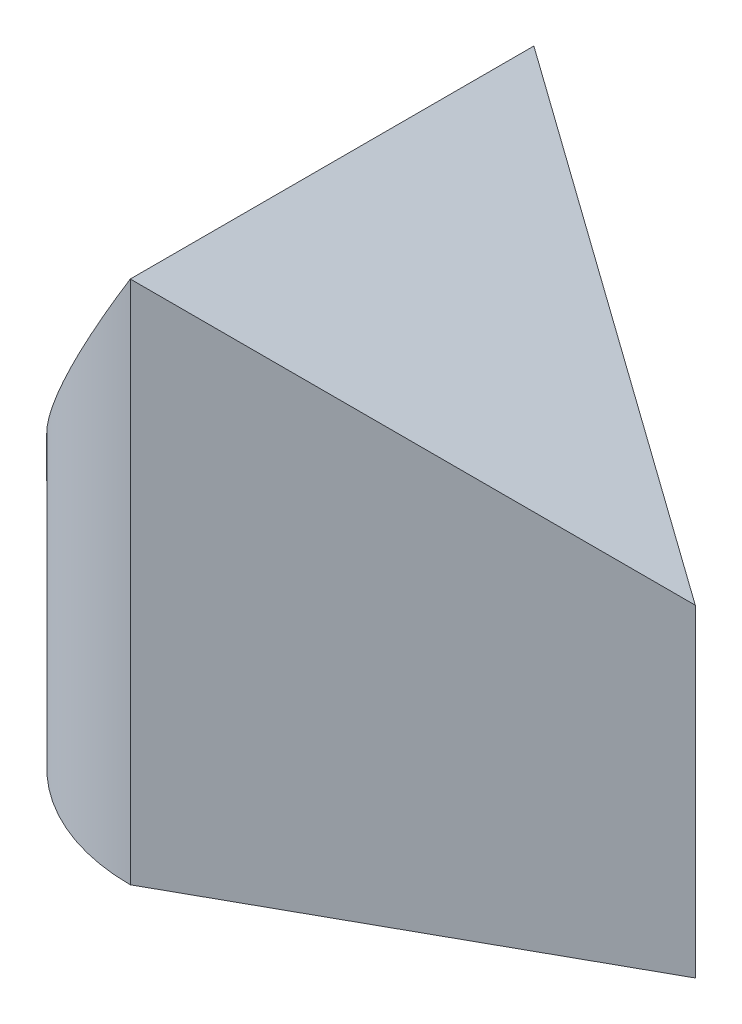
ISO-10303-21;
HEADER;
FILE_DESCRIPTION(('STEP AP214'),'2;1');
FILE_NAME('part.step','',(''),(''),'','','');
FILE_SCHEMA(('AUTOMOTIVE_DESIGN { 1 0 10303 214 1 1 1 1 }'));
ENDSEC;
DATA;
#1=APPLICATION_CONTEXT('core data for automotive mechanical design processes');
#2=APPLICATION_PROTOCOL_DEFINITION('international standard','automotive_design',2000,#1);
#3=PRODUCT_CONTEXT('',#1,'mechanical');
#4=PRODUCT('Part','Part','',(#3));
#5=PRODUCT_RELATED_PRODUCT_CATEGORY('part','',(#4));
#6=PRODUCT_DEFINITION_FORMATION('','',#4);
#7=PRODUCT_DEFINITION_CONTEXT('part definition',#1,'design');
#8=PRODUCT_DEFINITION('design','',#6,#7);
#9=PRODUCT_DEFINITION_SHAPE('','',#8);
#10=(LENGTH_UNIT() NAMED_UNIT(*) SI_UNIT(.MILLI.,.METRE.));
#11=(NAMED_UNIT(*) PLANE_ANGLE_UNIT() SI_UNIT($,.RADIAN.));
#12=(NAMED_UNIT(*) SI_UNIT($,.STERADIAN.) SOLID_ANGLE_UNIT());
#13=UNCERTAINTY_MEASURE_WITH_UNIT(LENGTH_MEASURE(1.E-05),#10,'distance_accuracy_value','');
#14=(GEOMETRIC_REPRESENTATION_CONTEXT(3) GLOBAL_UNCERTAINTY_ASSIGNED_CONTEXT((#13)) GLOBAL_UNIT_ASSIGNED_CONTEXT((#10,
#11,#12)) REPRESENTATION_CONTEXT('',''));
#15=CARTESIAN_POINT('',(0.,0.,0.));
#16=DIRECTION('',(0.,0.,1.));
#17=DIRECTION('',(1.,0.,0.));
#18=AXIS2_PLACEMENT_3D('',#15,#16,#17);
#19=CARTESIAN_POINT('',(45.,65.,0.));
#20=DIRECTION('',(-0.485642931178632,0.,-0.874157276121538));
#21=DIRECTION('',(-0.874157276121538,0.,0.485642931178632));
#22=AXIS2_PLACEMENT_3D('',#19,#20,#21);
#23=PLANE('',#22);
#24=DIRECTION('',(0.786333650994934,-0.436852028330519,-0.436852028330519));
#25=VECTOR('',#24,1.);
#26=CARTESIAN_POINT('',(36.412213740458,44.7709923664122,4.77099236641221));
#27=LINE('',#26,#25);
#28=CARTESIAN_POINT('',(0.,65.,25.));
#29=VERTEX_POINT('',#28);
#30=CARTESIAN_POINT('',(45.,40.,0.));
#31=VERTEX_POINT('',#30);
#32=EDGE_CURVE('E85',#29,#31,#27,.T.);
#33=ORIENTED_EDGE('',*,*,#32,.F.);
#34=DIRECTION('',(0.,-1.,0.));
#35=VECTOR('',#34,1.);
#36=CARTESIAN_POINT('',(0.,65.,25.));
#37=LINE('',#36,#35);
#38=CARTESIAN_POINT('',(0.,0.,25.));
#39=VERTEX_POINT('',#38);
#40=EDGE_CURVE('E12',#29,#39,#37,.T.);
#41=ORIENTED_EDGE('',*,*,#40,.T.);
#42=DIRECTION('',(0.874157276121538,0.,-0.485642931178632));
#43=VECTOR('',#42,1.);
#44=CARTESIAN_POINT('',(45.,0.,0.));
#45=LINE('',#44,#43);
#46=CARTESIAN_POINT('',(45.,0.,0.));
#47=VERTEX_POINT('',#46);
#48=EDGE_CURVE('E103',#39,#47,#45,.T.);
#49=ORIENTED_EDGE('',*,*,#48,.T.);
#50=DIRECTION('',(0.,-1.,0.));
#51=VECTOR('',#50,1.);
#52=CARTESIAN_POINT('',(45.,65.,0.));
#53=LINE('',#52,#51);
#54=EDGE_CURVE('E56',#31,#47,#53,.T.);
#55=ORIENTED_EDGE('',*,*,#54,.F.);
#56=EDGE_LOOP('',(#33,#41,#49,#55));
#57=FACE_BOUND('',#56,.T.);
#58=ADVANCED_FACE('F48',(#57),#23,.F.);
#59=CARTESIAN_POINT('',(0.,65.,-25.));
#60=DIRECTION('',(-0.485642931178632,0.,0.874157276121538));
#61=DIRECTION('',(0.874157276121538,0.,0.485642931178632));
#62=AXIS2_PLACEMENT_3D('',#59,#60,#61);
#63=PLANE('',#62);
#64=DIRECTION('',(-0.786333650994934,0.436852028330519,-0.436852028330519));
#65=VECTOR('',#64,1.);
#66=CARTESIAN_POINT('',(0.,65.,-25.));
#67=LINE('',#66,#65);
#68=CARTESIAN_POINT('',(0.,65.,-25.));
#69=VERTEX_POINT('',#68);
#70=EDGE_CURVE('E86',#31,#69,#67,.T.);
#71=ORIENTED_EDGE('',*,*,#70,.F.);
#72=ORIENTED_EDGE('',*,*,#54,.T.);
#73=DIRECTION('',(-0.874157276121538,0.,-0.485642931178632));
#74=VECTOR('',#73,1.);
#75=CARTESIAN_POINT('',(0.,0.,-25.));
#76=LINE('',#75,#74);
#77=CARTESIAN_POINT('',(0.,0.,-25.));
#78=VERTEX_POINT('',#77);
#79=EDGE_CURVE('E63',#47,#78,#76,.T.);
#80=ORIENTED_EDGE('',*,*,#79,.T.);
#81=DIRECTION('',(0.,-1.,0.));
#82=VECTOR('',#81,1.);
#83=CARTESIAN_POINT('',(0.,65.,-25.));
#84=LINE('',#83,#82);
#85=EDGE_CURVE('E101',#69,#78,#84,.T.);
#86=ORIENTED_EDGE('',*,*,#85,.F.);
#87=EDGE_LOOP('',(#71,#72,#80,#86));
#88=FACE_BOUND('',#87,.T.);
#89=ADVANCED_FACE('F117',(#88),#63,.F.);
#90=CARTESIAN_POINT('',(0.,65.,0.));
#91=DIRECTION('',(0.,-1.,0.));
#92=DIRECTION('',(0.,0.,-1.));
#93=AXIS2_PLACEMENT_3D('',#90,#91,#92);
#94=CYLINDRICAL_SURFACE('',#93,25.);
#95=CARTESIAN_POINT('',(0.,65.,0.));
#96=DIRECTION('',(0.853796175794036,-0.520607424264656,0.));
#97=DIRECTION('',(-0.520607424264656,-0.853796175794036,0.));
#98=AXIS2_PLACEMENT_3D('',#95,#96,#97);
#99=ELLIPSE('',#98,48.0208288141719,25.);
#100=EDGE_CURVE('E90',#29,#69,#99,.T.);
#101=ORIENTED_EDGE('',*,*,#100,.T.);
#102=ORIENTED_EDGE('',*,*,#85,.T.);
#103=CARTESIAN_POINT('',(0.,0.,0.));
#104=DIRECTION('',(0.,1.,0.));
#105=DIRECTION('',(0.,0.,1.));
#106=AXIS2_PLACEMENT_3D('',#103,#104,#105);
#107=CIRCLE('',#106,25.);
#108=EDGE_CURVE('E98',#78,#39,#107,.T.);
#109=ORIENTED_EDGE('',*,*,#108,.T.);
#110=ORIENTED_EDGE('',*,*,#40,.F.);
#111=EDGE_LOOP('',(#101,#102,#109,#110));
#112=FACE_BOUND('',#111,.T.);
#113=ADVANCED_FACE('F50',(#112),#94,.T.);
#114=CARTESIAN_POINT('',(0.,0.,0.));
#115=DIRECTION('',(0.,1.,0.));
#116=DIRECTION('',(0.,0.,1.));
#117=AXIS2_PLACEMENT_3D('',#114,#115,#116);
#118=PLANE('',#117);
#119=ORIENTED_EDGE('',*,*,#108,.F.);
#120=ORIENTED_EDGE('',*,*,#79,.F.);
#121=ORIENTED_EDGE('',*,*,#48,.F.);
#122=EDGE_LOOP('',(#119,#120,#121));
#123=FACE_BOUND('',#122,.T.);
#124=ADVANCED_FACE('F109',(#123),#118,.F.);
#125=CARTESIAN_POINT('',(-25.,24.,-25.));
#126=DIRECTION('',(0.853796175794036,-0.520607424264656,0.));
#127=DIRECTION('',(0.520607424264656,0.853796175794036,0.));
#128=AXIS2_PLACEMENT_3D('',#125,#126,#127);
#129=PLANE('',#128);
#130=ORIENTED_EDGE('',*,*,#100,.F.);
#131=DIRECTION('',(0.,0.,1.));
#132=VECTOR('',#131,1.);
#133=CARTESIAN_POINT('',(0.,65.,-25.));
#134=LINE('',#133,#132);
#135=EDGE_CURVE('E82',#69,#29,#134,.T.);
#136=ORIENTED_EDGE('',*,*,#135,.F.);
#137=EDGE_LOOP('',(#130,#136));
#138=FACE_BOUND('',#137,.T.);
#139=ADVANCED_FACE('F96',(#138),#129,.F.);
#140=CARTESIAN_POINT('',(45.,40.,-25.));
#141=DIRECTION('',(0.485642931178632,0.874157276121538,0.));
#142=DIRECTION('',(-0.874157276121538,0.485642931178632,0.));
#143=AXIS2_PLACEMENT_3D('',#140,#141,#142);
#144=PLANE('',#143);
#145=ORIENTED_EDGE('',*,*,#32,.T.);
#146=ORIENTED_EDGE('',*,*,#70,.T.);
#147=ORIENTED_EDGE('',*,*,#135,.T.);
#148=EDGE_LOOP('',(#145,#146,#147));
#149=FACE_BOUND('',#148,.T.);
#150=ADVANCED_FACE('F84',(#149),#144,.T.);
#151=CLOSED_SHELL('',(#58,#89,#113,#124,#139,#150));
#152=MANIFOLD_SOLID_BREP('B2',#151);
#153=ADVANCED_BREP_SHAPE_REPRESENTATION('',(#18,#152),#14);
#154=SHAPE_DEFINITION_REPRESENTATION(#9,#153);
ENDSEC;
END-ISO-10303-21;
